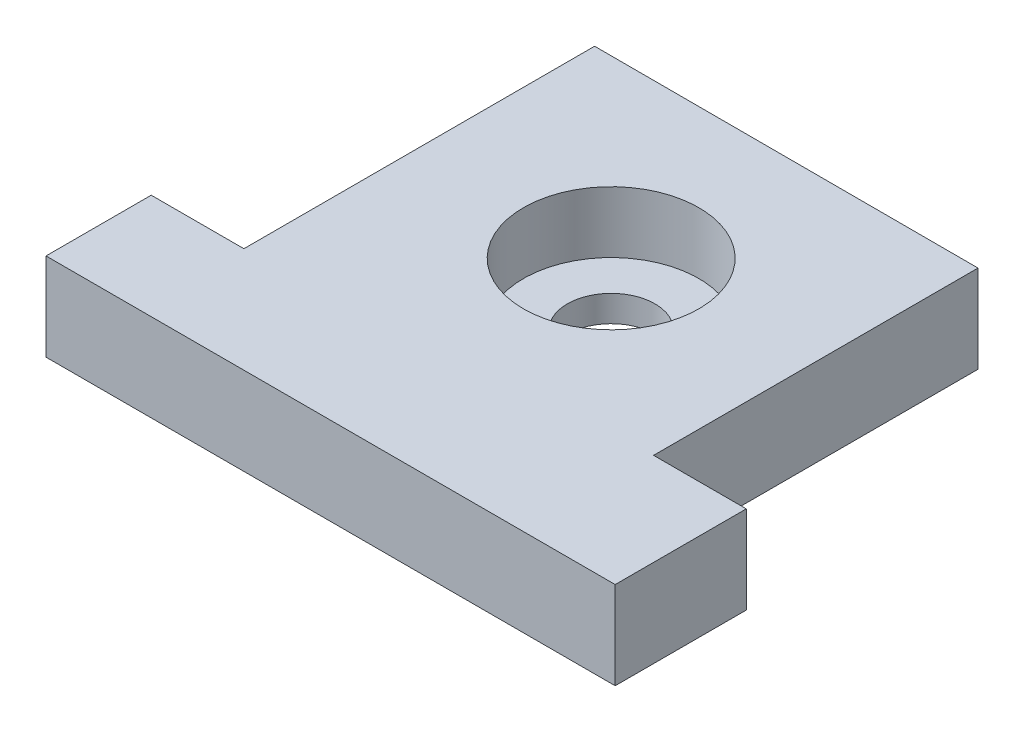
ISO-10303-21;
HEADER;
FILE_DESCRIPTION(('STEP AP214'),'2;1');
FILE_NAME('part.step','',(''),(''),'','','');
FILE_SCHEMA(('AUTOMOTIVE_DESIGN { 1 0 10303 214 1 1 1 1 }'));
ENDSEC;
DATA;
#1=APPLICATION_CONTEXT('core data for automotive mechanical design processes');
#2=APPLICATION_PROTOCOL_DEFINITION('international standard','automotive_design',2000,#1);
#3=PRODUCT_CONTEXT('',#1,'mechanical');
#4=PRODUCT('Part','Part','',(#3));
#5=PRODUCT_RELATED_PRODUCT_CATEGORY('part','',(#4));
#6=PRODUCT_DEFINITION_FORMATION('','',#4);
#7=PRODUCT_DEFINITION_CONTEXT('part definition',#1,'design');
#8=PRODUCT_DEFINITION('design','',#6,#7);
#9=PRODUCT_DEFINITION_SHAPE('','',#8);
#10=(LENGTH_UNIT() NAMED_UNIT(*) SI_UNIT(.MILLI.,.METRE.));
#11=(NAMED_UNIT(*) PLANE_ANGLE_UNIT() SI_UNIT($,.RADIAN.));
#12=(NAMED_UNIT(*) SI_UNIT($,.STERADIAN.) SOLID_ANGLE_UNIT());
#13=UNCERTAINTY_MEASURE_WITH_UNIT(LENGTH_MEASURE(1.E-05),#10,'distance_accuracy_value','');
#14=(GEOMETRIC_REPRESENTATION_CONTEXT(3) GLOBAL_UNCERTAINTY_ASSIGNED_CONTEXT((#13)) GLOBAL_UNIT_ASSIGNED_CONTEXT((#10,
#11,#12)) REPRESENTATION_CONTEXT('',''));
#15=CARTESIAN_POINT('',(0.,0.,0.));
#16=DIRECTION('',(0.,0.,1.));
#17=DIRECTION('',(1.,0.,0.));
#18=AXIS2_PLACEMENT_3D('',#15,#16,#17);
#19=CARTESIAN_POINT('',(0.0564804454629676,10.,-51.9761547369226));
#20=DIRECTION('',(0.00108666007329569,0.,-0.999999409584768));
#21=DIRECTION('',(-0.999999409584768,0.,-0.00108666007329569));
#22=AXIS2_PLACEMENT_3D('',#19,#20,#21);
#23=PLANE('',#22);
#24=DIRECTION('',(0.999999409584768,0.,0.00108666007329569));
#25=VECTOR('',#24,1.);
#26=CARTESIAN_POINT('',(0.0564804454629676,0.,-51.9761547369226));
#27=LINE('',#26,#25);
#28=CARTESIAN_POINT('',(-21.887133371598,0.,-52.));
#29=VERTEX_POINT('',#28);
#30=CARTESIAN_POINT('',(21.887133371598,0.,-51.9524322240076));
#31=VERTEX_POINT('',#30);
#32=EDGE_CURVE('E139',#29,#31,#27,.T.);
#33=ORIENTED_EDGE('',*,*,#32,.F.);
#34=DIRECTION('',(0.,-1.,0.));
#35=VECTOR('',#34,1.);
#36=CARTESIAN_POINT('',(-21.887133371598,10.,-52.));
#37=LINE('',#36,#35);
#38=CARTESIAN_POINT('',(-21.887133371598,10.,-52.));
#39=VERTEX_POINT('',#38);
#40=EDGE_CURVE('E11',#39,#29,#37,.T.);
#41=ORIENTED_EDGE('',*,*,#40,.F.);
#42=DIRECTION('',(0.999999409584768,0.,0.00108666007329569));
#43=VECTOR('',#42,1.);
#44=CARTESIAN_POINT('',(0.0564804454629676,10.,-51.9761547369226));
#45=LINE('',#44,#43);
#46=CARTESIAN_POINT('',(21.887133371598,10.,-51.9524322240076));
#47=VERTEX_POINT('',#46);
#48=EDGE_CURVE('E166',#39,#47,#45,.T.);
#49=ORIENTED_EDGE('',*,*,#48,.T.);
#50=DIRECTION('',(0.,-1.,0.));
#51=VECTOR('',#50,1.);
#52=CARTESIAN_POINT('',(21.887133371598,10.,-51.9524322240076));
#53=LINE('',#52,#51);
#54=EDGE_CURVE('E93',#47,#31,#53,.T.);
#55=ORIENTED_EDGE('',*,*,#54,.T.);
#56=EDGE_LOOP('',(#33,#41,#49,#55));
#57=FACE_BOUND('',#56,.T.);
#58=ADVANCED_FACE('F41',(#57),#23,.T.);
#59=CARTESIAN_POINT('',(-21.887133371598,10.,0.));
#60=DIRECTION('',(-1.,0.,0.));
#61=DIRECTION('',(0.,0.,1.));
#62=AXIS2_PLACEMENT_3D('',#59,#60,#61);
#63=PLANE('',#62);
#64=DIRECTION('',(0.,0.,-1.));
#65=VECTOR('',#64,1.);
#66=CARTESIAN_POINT('',(-21.887133371598,0.,0.));
#67=LINE('',#66,#65);
#68=CARTESIAN_POINT('',(-21.887133371598,0.,-12.));
#69=VERTEX_POINT('',#68);
#70=EDGE_CURVE('E143',#69,#29,#67,.T.);
#71=ORIENTED_EDGE('',*,*,#70,.F.);
#72=DIRECTION('',(0.,-1.,0.));
#73=VECTOR('',#72,1.);
#74=CARTESIAN_POINT('',(-21.887133371598,10.,-12.));
#75=LINE('',#74,#73);
#76=CARTESIAN_POINT('',(-21.887133371598,10.,-12.));
#77=VERTEX_POINT('',#76);
#78=EDGE_CURVE('E50',#77,#69,#75,.T.);
#79=ORIENTED_EDGE('',*,*,#78,.F.);
#80=DIRECTION('',(0.,0.,-1.));
#81=VECTOR('',#80,1.);
#82=CARTESIAN_POINT('',(-21.887133371598,10.,0.));
#83=LINE('',#82,#81);
#84=EDGE_CURVE('E198',#77,#39,#83,.T.);
#85=ORIENTED_EDGE('',*,*,#84,.T.);
#86=ORIENTED_EDGE('',*,*,#40,.T.);
#87=EDGE_LOOP('',(#71,#79,#85,#86));
#88=FACE_BOUND('',#87,.T.);
#89=ADVANCED_FACE('F189',(#88),#63,.T.);
#90=CARTESIAN_POINT('',(0.,10.,-12.));
#91=DIRECTION('',(0.,0.,-1.));
#92=DIRECTION('',(-1.,0.,0.));
#93=AXIS2_PLACEMENT_3D('',#90,#91,#92);
#94=PLANE('',#93);
#95=DIRECTION('',(1.,0.,0.));
#96=VECTOR('',#95,1.);
#97=CARTESIAN_POINT('',(0.,0.,-12.));
#98=LINE('',#97,#96);
#99=CARTESIAN_POINT('',(-32.4585619430266,0.,-12.));
#100=VERTEX_POINT('',#99);
#101=EDGE_CURVE('E148',#100,#69,#98,.T.);
#102=ORIENTED_EDGE('',*,*,#101,.F.);
#103=DIRECTION('',(0.,-1.,0.));
#104=VECTOR('',#103,1.);
#105=CARTESIAN_POINT('',(-32.4585619430266,10.,-12.));
#106=LINE('',#105,#104);
#107=CARTESIAN_POINT('',(-32.4585619430266,10.,-12.));
#108=VERTEX_POINT('',#107);
#109=EDGE_CURVE('E176',#108,#100,#106,.T.);
#110=ORIENTED_EDGE('',*,*,#109,.F.);
#111=DIRECTION('',(1.,0.,0.));
#112=VECTOR('',#111,1.);
#113=CARTESIAN_POINT('',(0.,10.,-12.));
#114=LINE('',#113,#112);
#115=EDGE_CURVE('E185',#108,#77,#114,.T.);
#116=ORIENTED_EDGE('',*,*,#115,.T.);
#117=ORIENTED_EDGE('',*,*,#78,.T.);
#118=EDGE_LOOP('',(#102,#110,#116,#117));
#119=FACE_BOUND('',#118,.T.);
#120=ADVANCED_FACE('F183',(#119),#94,.T.);
#121=CARTESIAN_POINT('',(-32.4585619430266,10.,0.));
#122=DIRECTION('',(-1.,0.,0.));
#123=DIRECTION('',(0.,0.,1.));
#124=AXIS2_PLACEMENT_3D('',#121,#122,#123);
#125=PLANE('',#124);
#126=DIRECTION('',(0.,0.,-1.));
#127=VECTOR('',#126,1.);
#128=CARTESIAN_POINT('',(-32.4585619430266,0.,0.));
#129=LINE('',#128,#127);
#130=CARTESIAN_POINT('',(-32.4585619430266,0.,0.));
#131=VERTEX_POINT('',#130);
#132=EDGE_CURVE('E152',#131,#100,#129,.T.);
#133=ORIENTED_EDGE('',*,*,#132,.F.);
#134=DIRECTION('',(0.,-1.,0.));
#135=VECTOR('',#134,1.);
#136=CARTESIAN_POINT('',(-32.4585619430266,10.,0.));
#137=LINE('',#136,#135);
#138=CARTESIAN_POINT('',(-32.4585619430266,10.,0.));
#139=VERTEX_POINT('',#138);
#140=EDGE_CURVE('E173',#139,#131,#137,.T.);
#141=ORIENTED_EDGE('',*,*,#140,.F.);
#142=DIRECTION('',(0.,0.,-1.));
#143=VECTOR('',#142,1.);
#144=CARTESIAN_POINT('',(-32.4585619430266,10.,0.));
#145=LINE('',#144,#143);
#146=EDGE_CURVE('E197',#139,#108,#145,.T.);
#147=ORIENTED_EDGE('',*,*,#146,.T.);
#148=ORIENTED_EDGE('',*,*,#109,.T.);
#149=EDGE_LOOP('',(#133,#141,#147,#148));
#150=FACE_BOUND('',#149,.T.);
#151=ADVANCED_FACE('F195',(#150),#125,.T.);
#152=CARTESIAN_POINT('',(0.,10.,0.));
#153=DIRECTION('',(0.,0.,-1.));
#154=DIRECTION('',(-1.,0.,0.));
#155=AXIS2_PLACEMENT_3D('',#152,#153,#154);
#156=PLANE('',#155);
#157=DIRECTION('',(1.,0.,0.));
#158=VECTOR('',#157,1.);
#159=CARTESIAN_POINT('',(0.,0.,0.));
#160=LINE('',#159,#158);
#161=CARTESIAN_POINT('',(32.4585619430266,0.,0.));
#162=VERTEX_POINT('',#161);
#163=EDGE_CURVE('E156',#131,#162,#160,.T.);
#164=ORIENTED_EDGE('',*,*,#163,.T.);
#165=DIRECTION('',(0.,-1.,0.));
#166=VECTOR('',#165,1.);
#167=CARTESIAN_POINT('',(32.4585619430266,10.,0.));
#168=LINE('',#167,#166);
#169=CARTESIAN_POINT('',(32.4585619430266,10.,0.));
#170=VERTEX_POINT('',#169);
#171=EDGE_CURVE('E129',#170,#162,#168,.T.);
#172=ORIENTED_EDGE('',*,*,#171,.F.);
#173=DIRECTION('',(1.,0.,0.));
#174=VECTOR('',#173,1.);
#175=CARTESIAN_POINT('',(0.,10.,0.));
#176=LINE('',#175,#174);
#177=EDGE_CURVE('E118',#139,#170,#176,.T.);
#178=ORIENTED_EDGE('',*,*,#177,.F.);
#179=ORIENTED_EDGE('',*,*,#140,.T.);
#180=EDGE_LOOP('',(#164,#172,#178,#179));
#181=FACE_BOUND('',#180,.T.);
#182=ADVANCED_FACE('F266',(#181),#156,.F.);
#183=CARTESIAN_POINT('',(32.4585619430266,10.,0.));
#184=DIRECTION('',(-1.,0.,0.));
#185=DIRECTION('',(0.,0.,1.));
#186=AXIS2_PLACEMENT_3D('',#183,#184,#185);
#187=PLANE('',#186);
#188=DIRECTION('',(0.,0.,-1.));
#189=VECTOR('',#188,1.);
#190=CARTESIAN_POINT('',(32.4585619430266,0.,0.));
#191=LINE('',#190,#189);
#192=CARTESIAN_POINT('',(32.4585619430266,0.,-14.9524322240077));
#193=VERTEX_POINT('',#192);
#194=EDGE_CURVE('E127',#162,#193,#191,.T.);
#195=ORIENTED_EDGE('',*,*,#194,.T.);
#196=DIRECTION('',(0.,-1.,0.));
#197=VECTOR('',#196,1.);
#198=CARTESIAN_POINT('',(32.4585619430266,10.,-14.9524322240077));
#199=LINE('',#198,#197);
#200=CARTESIAN_POINT('',(32.4585619430266,10.,-14.9524322240077));
#201=VERTEX_POINT('',#200);
#202=EDGE_CURVE('E124',#201,#193,#199,.T.);
#203=ORIENTED_EDGE('',*,*,#202,.F.);
#204=DIRECTION('',(0.,0.,-1.));
#205=VECTOR('',#204,1.);
#206=CARTESIAN_POINT('',(32.4585619430266,10.,0.));
#207=LINE('',#206,#205);
#208=EDGE_CURVE('E111',#170,#201,#207,.T.);
#209=ORIENTED_EDGE('',*,*,#208,.F.);
#210=ORIENTED_EDGE('',*,*,#171,.T.);
#211=EDGE_LOOP('',(#195,#203,#209,#210));
#212=FACE_BOUND('',#211,.T.);
#213=ADVANCED_FACE('F125',(#212),#187,.F.);
#214=CARTESIAN_POINT('',(0.,10.,-14.9524322240077));
#215=DIRECTION('',(0.,0.,1.));
#216=DIRECTION('',(1.,0.,0.));
#217=AXIS2_PLACEMENT_3D('',#214,#215,#216);
#218=PLANE('',#217);
#219=DIRECTION('',(-1.,0.,0.));
#220=VECTOR('',#219,1.);
#221=CARTESIAN_POINT('',(0.,0.,-14.9524322240077));
#222=LINE('',#221,#220);
#223=CARTESIAN_POINT('',(21.887133371598,0.,-14.9524322240077));
#224=VERTEX_POINT('',#223);
#225=EDGE_CURVE('E86',#193,#224,#222,.T.);
#226=ORIENTED_EDGE('',*,*,#225,.T.);
#227=DIRECTION('',(0.,-1.,0.));
#228=VECTOR('',#227,1.);
#229=CARTESIAN_POINT('',(21.887133371598,10.,-14.9524322240077));
#230=LINE('',#229,#228);
#231=CARTESIAN_POINT('',(21.887133371598,10.,-14.9524322240077));
#232=VERTEX_POINT('',#231);
#233=EDGE_CURVE('E130',#232,#224,#230,.T.);
#234=ORIENTED_EDGE('',*,*,#233,.F.);
#235=DIRECTION('',(-1.,0.,0.));
#236=VECTOR('',#235,1.);
#237=CARTESIAN_POINT('',(0.,10.,-14.9524322240077));
#238=LINE('',#237,#236);
#239=EDGE_CURVE('E115',#201,#232,#238,.T.);
#240=ORIENTED_EDGE('',*,*,#239,.F.);
#241=ORIENTED_EDGE('',*,*,#202,.T.);
#242=EDGE_LOOP('',(#226,#234,#240,#241));
#243=FACE_BOUND('',#242,.T.);
#244=ADVANCED_FACE('F132',(#243),#218,.F.);
#245=CARTESIAN_POINT('',(21.887133371598,10.,0.));
#246=DIRECTION('',(-1.,0.,0.));
#247=DIRECTION('',(0.,0.,1.));
#248=AXIS2_PLACEMENT_3D('',#245,#246,#247);
#249=PLANE('',#248);
#250=DIRECTION('',(0.,0.,-1.));
#251=VECTOR('',#250,1.);
#252=CARTESIAN_POINT('',(21.887133371598,0.,0.));
#253=LINE('',#252,#251);
#254=EDGE_CURVE('E163',#224,#31,#253,.T.);
#255=ORIENTED_EDGE('',*,*,#254,.T.);
#256=ORIENTED_EDGE('',*,*,#54,.F.);
#257=DIRECTION('',(0.,0.,-1.));
#258=VECTOR('',#257,1.);
#259=CARTESIAN_POINT('',(21.887133371598,10.,0.));
#260=LINE('',#259,#258);
#261=EDGE_CURVE('E58',#232,#47,#260,.T.);
#262=ORIENTED_EDGE('',*,*,#261,.F.);
#263=ORIENTED_EDGE('',*,*,#233,.T.);
#264=EDGE_LOOP('',(#255,#256,#262,#263));
#265=FACE_BOUND('',#264,.T.);
#266=ADVANCED_FACE('F245',(#265),#249,.F.);
#267=CARTESIAN_POINT('',(0.,10.,0.));
#268=DIRECTION('',(0.,1.,0.));
#269=DIRECTION('',(0.,0.,1.));
#270=AXIS2_PLACEMENT_3D('',#267,#268,#269);
#271=PLANE('',#270);
#272=CARTESIAN_POINT('',(0.,10.,-32.));
#273=DIRECTION('',(0.,1.,0.));
#274=DIRECTION('',(0.,0.,1.));
#275=AXIS2_PLACEMENT_3D('',#272,#273,#274);
#276=CIRCLE('',#275,10.);
#277=CARTESIAN_POINT('',(0.,10.,-22.));
#278=VERTEX_POINT('',#277);
#279=EDGE_CURVE('E209',#278,#278,#276,.T.);
#280=ORIENTED_EDGE('',*,*,#279,.F.);
#281=EDGE_LOOP('',(#280));
#282=FACE_BOUND('',#281,.T.);
#283=ORIENTED_EDGE('',*,*,#48,.F.);
#284=ORIENTED_EDGE('',*,*,#84,.F.);
#285=ORIENTED_EDGE('',*,*,#115,.F.);
#286=ORIENTED_EDGE('',*,*,#146,.F.);
#287=ORIENTED_EDGE('',*,*,#177,.T.);
#288=ORIENTED_EDGE('',*,*,#208,.T.);
#289=ORIENTED_EDGE('',*,*,#239,.T.);
#290=ORIENTED_EDGE('',*,*,#261,.T.);
#291=EDGE_LOOP('',(#283,#284,#285,#286,#287,#288,#289,#290));
#292=FACE_BOUND('',#291,.T.);
#293=ADVANCED_FACE('F113',(#282,#292),#271,.T.);
#294=CARTESIAN_POINT('',(0.,0.,0.));
#295=DIRECTION('',(0.,1.,0.));
#296=DIRECTION('',(0.,0.,1.));
#297=AXIS2_PLACEMENT_3D('',#294,#295,#296);
#298=PLANE('',#297);
#299=CARTESIAN_POINT('',(0.,0.,-32.));
#300=DIRECTION('',(0.,1.,0.));
#301=DIRECTION('',(0.,0.,1.));
#302=AXIS2_PLACEMENT_3D('',#299,#300,#301);
#303=CIRCLE('',#302,5.);
#304=CARTESIAN_POINT('',(0.,0.,-27.));
#305=VERTEX_POINT('',#304);
#306=EDGE_CURVE('E213',#305,#305,#303,.T.);
#307=ORIENTED_EDGE('',*,*,#306,.T.);
#308=EDGE_LOOP('',(#307));
#309=FACE_BOUND('',#308,.T.);
#310=ORIENTED_EDGE('',*,*,#32,.T.);
#311=ORIENTED_EDGE('',*,*,#254,.F.);
#312=ORIENTED_EDGE('',*,*,#225,.F.);
#313=ORIENTED_EDGE('',*,*,#194,.F.);
#314=ORIENTED_EDGE('',*,*,#163,.F.);
#315=ORIENTED_EDGE('',*,*,#132,.T.);
#316=ORIENTED_EDGE('',*,*,#101,.T.);
#317=ORIENTED_EDGE('',*,*,#70,.T.);
#318=EDGE_LOOP('',(#310,#311,#312,#313,#314,#315,#316,#317));
#319=FACE_BOUND('',#318,.T.);
#320=ADVANCED_FACE('F191',(#309,#319),#298,.F.);
#321=CARTESIAN_POINT('',(0.,3.,-32.));
#322=DIRECTION('',(0.,1.,0.));
#323=DIRECTION('',(0.,0.,1.));
#324=AXIS2_PLACEMENT_3D('',#321,#322,#323);
#325=CYLINDRICAL_SURFACE('',#324,10.);
#326=CARTESIAN_POINT('',(0.,3.,-32.));
#327=DIRECTION('',(0.,1.,0.));
#328=DIRECTION('',(0.,0.,1.));
#329=AXIS2_PLACEMENT_3D('',#326,#327,#328);
#330=CIRCLE('',#329,10.);
#331=CARTESIAN_POINT('',(0.,3.,-22.));
#332=VERTEX_POINT('',#331);
#333=EDGE_CURVE('E144',#332,#332,#330,.T.);
#334=ORIENTED_EDGE('',*,*,#333,.F.);
#335=EDGE_LOOP('',(#334));
#336=FACE_BOUND('',#335,.T.);
#337=ORIENTED_EDGE('',*,*,#279,.T.);
#338=EDGE_LOOP('',(#337));
#339=FACE_BOUND('',#338,.T.);
#340=ADVANCED_FACE('F235',(#336,#339),#325,.F.);
#341=CARTESIAN_POINT('',(0.,3.,-32.));
#342=DIRECTION('',(0.,1.,0.));
#343=DIRECTION('',(0.,0.,1.));
#344=AXIS2_PLACEMENT_3D('',#341,#342,#343);
#345=PLANE('',#344);
#346=CARTESIAN_POINT('',(0.,3.,-32.));
#347=DIRECTION('',(0.,1.,0.));
#348=DIRECTION('',(0.,0.,1.));
#349=AXIS2_PLACEMENT_3D('',#346,#347,#348);
#350=CIRCLE('',#349,5.);
#351=CARTESIAN_POINT('',(0.,3.,-27.));
#352=VERTEX_POINT('',#351);
#353=EDGE_CURVE('E217',#352,#352,#350,.T.);
#354=ORIENTED_EDGE('',*,*,#353,.F.);
#355=EDGE_LOOP('',(#354));
#356=FACE_BOUND('',#355,.T.);
#357=ORIENTED_EDGE('',*,*,#333,.T.);
#358=EDGE_LOOP('',(#357));
#359=FACE_BOUND('',#358,.T.);
#360=ADVANCED_FACE('F229',(#356,#359),#345,.T.);
#361=CARTESIAN_POINT('',(0.,0.,-32.));
#362=DIRECTION('',(0.,1.,0.));
#363=DIRECTION('',(0.,0.,1.));
#364=AXIS2_PLACEMENT_3D('',#361,#362,#363);
#365=CYLINDRICAL_SURFACE('',#364,5.);
#366=ORIENTED_EDGE('',*,*,#306,.F.);
#367=EDGE_LOOP('',(#366));
#368=FACE_BOUND('',#367,.T.);
#369=ORIENTED_EDGE('',*,*,#353,.T.);
#370=EDGE_LOOP('',(#369));
#371=FACE_BOUND('',#370,.T.);
#372=ADVANCED_FACE('F226',(#368,#371),#365,.F.);
#373=CLOSED_SHELL('',(#58,#89,#120,#151,#182,#213,#244,#266,#293,#320,#340,#360,#372));
#374=MANIFOLD_SOLID_BREP('B2',#373);
#375=ADVANCED_BREP_SHAPE_REPRESENTATION('',(#18,#374),#14);
#376=SHAPE_DEFINITION_REPRESENTATION(#9,#375);
ENDSEC;
END-ISO-10303-21;
